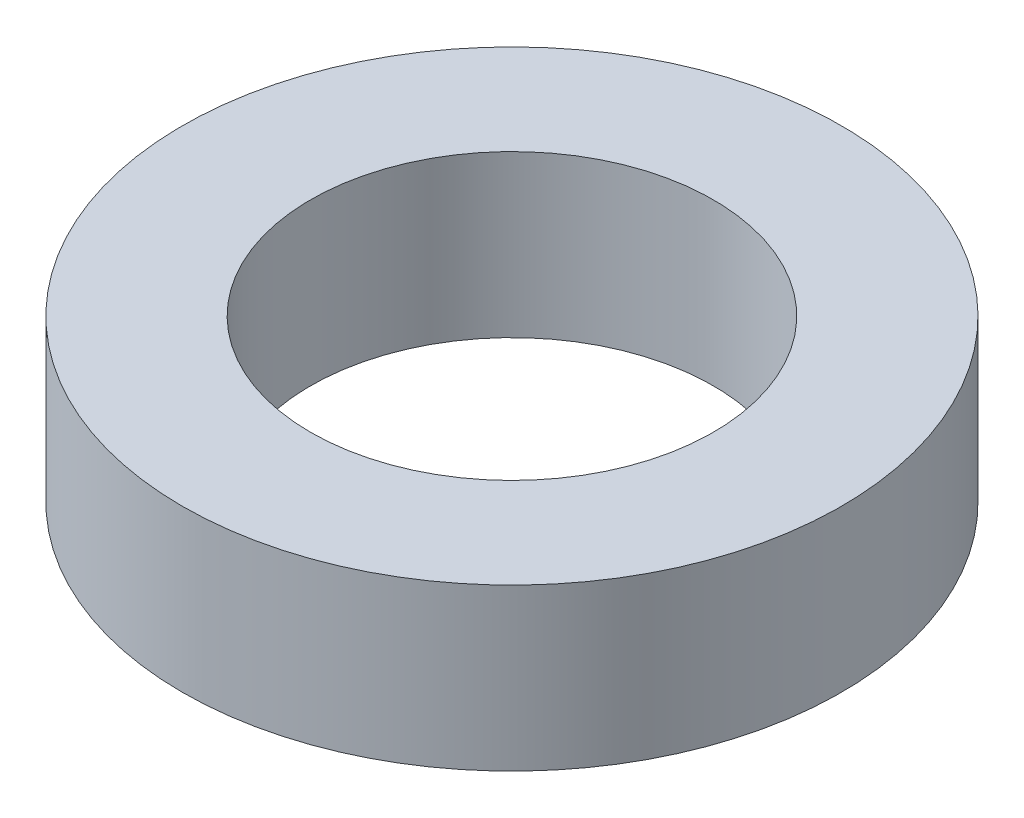
ISO-10303-21;
HEADER;
FILE_DESCRIPTION(('STEP AP214'),'2;1');
FILE_NAME('part.step','',(''),(''),'','','');
FILE_SCHEMA(('AUTOMOTIVE_DESIGN { 1 0 10303 214 1 1 1 1 }'));
ENDSEC;
DATA;
#1=APPLICATION_CONTEXT('core data for automotive mechanical design processes');
#2=APPLICATION_PROTOCOL_DEFINITION('international standard','automotive_design',2000,#1);
#3=PRODUCT_CONTEXT('',#1,'mechanical');
#4=PRODUCT('Part','Part','',(#3));
#5=PRODUCT_RELATED_PRODUCT_CATEGORY('part','',(#4));
#6=PRODUCT_DEFINITION_FORMATION('','',#4);
#7=PRODUCT_DEFINITION_CONTEXT('part definition',#1,'design');
#8=PRODUCT_DEFINITION('design','',#6,#7);
#9=PRODUCT_DEFINITION_SHAPE('','',#8);
#10=(LENGTH_UNIT() NAMED_UNIT(*) SI_UNIT(.MILLI.,.METRE.));
#11=(NAMED_UNIT(*) PLANE_ANGLE_UNIT() SI_UNIT($,.RADIAN.));
#12=(NAMED_UNIT(*) SI_UNIT($,.STERADIAN.) SOLID_ANGLE_UNIT());
#13=UNCERTAINTY_MEASURE_WITH_UNIT(LENGTH_MEASURE(1.E-05),#10,'distance_accuracy_value','');
#14=(GEOMETRIC_REPRESENTATION_CONTEXT(3) GLOBAL_UNCERTAINTY_ASSIGNED_CONTEXT((#13)) GLOBAL_UNIT_ASSIGNED_CONTEXT((#10,
#11,#12)) REPRESENTATION_CONTEXT('',''));
#15=CARTESIAN_POINT('',(0.,0.,0.));
#16=DIRECTION('',(0.,0.,1.));
#17=DIRECTION('',(1.,0.,0.));
#18=AXIS2_PLACEMENT_3D('',#15,#16,#17);
#19=CARTESIAN_POINT('',(0.,22.,0.));
#20=DIRECTION('',(0.,-1.,0.));
#21=DIRECTION('',(0.,0.,-1.));
#22=AXIS2_PLACEMENT_3D('',#19,#20,#21);
#23=CYLINDRICAL_SURFACE('',#22,45.);
#24=CARTESIAN_POINT('',(0.,22.,0.));
#25=DIRECTION('',(0.,1.,0.));
#26=DIRECTION('',(0.,0.,1.));
#27=AXIS2_PLACEMENT_3D('',#24,#25,#26);
#28=CIRCLE('',#27,45.);
#29=CARTESIAN_POINT('',(0.,22.,45.));
#30=VERTEX_POINT('',#29);
#31=EDGE_CURVE('E10',#30,#30,#28,.T.);
#32=ORIENTED_EDGE('',*,*,#31,.F.);
#33=EDGE_LOOP('',(#32));
#34=FACE_BOUND('',#33,.T.);
#35=CARTESIAN_POINT('',(0.,0.,0.));
#36=DIRECTION('',(0.,1.,0.));
#37=DIRECTION('',(0.,0.,1.));
#38=AXIS2_PLACEMENT_3D('',#35,#36,#37);
#39=CIRCLE('',#38,45.);
#40=CARTESIAN_POINT('',(0.,0.,45.));
#41=VERTEX_POINT('',#40);
#42=EDGE_CURVE('E37',#41,#41,#39,.T.);
#43=ORIENTED_EDGE('',*,*,#42,.T.);
#44=EDGE_LOOP('',(#43));
#45=FACE_BOUND('',#44,.T.);
#46=ADVANCED_FACE('F40',(#34,#45),#23,.T.);
#47=CARTESIAN_POINT('',(0.,22.,0.));
#48=DIRECTION('',(0.,1.,0.));
#49=DIRECTION('',(0.,0.,1.));
#50=AXIS2_PLACEMENT_3D('',#47,#48,#49);
#51=PLANE('',#50);
#52=CARTESIAN_POINT('',(0.,22.,0.));
#53=DIRECTION('',(0.,1.,0.));
#54=DIRECTION('',(0.,0.,1.));
#55=AXIS2_PLACEMENT_3D('',#52,#53,#54);
#56=CIRCLE('',#55,27.5);
#57=CARTESIAN_POINT('',(0.,22.,27.5));
#58=VERTEX_POINT('',#57);
#59=EDGE_CURVE('E50',#58,#58,#56,.T.);
#60=ORIENTED_EDGE('',*,*,#59,.F.);
#61=EDGE_LOOP('',(#60));
#62=FACE_BOUND('',#61,.T.);
#63=ORIENTED_EDGE('',*,*,#31,.T.);
#64=EDGE_LOOP('',(#63));
#65=FACE_BOUND('',#64,.T.);
#66=ADVANCED_FACE('F59',(#62,#65),#51,.T.);
#67=CARTESIAN_POINT('',(0.,0.,0.));
#68=DIRECTION('',(0.,1.,0.));
#69=DIRECTION('',(0.,0.,1.));
#70=AXIS2_PLACEMENT_3D('',#67,#68,#69);
#71=PLANE('',#70);
#72=CARTESIAN_POINT('',(0.,0.,0.));
#73=DIRECTION('',(0.,1.,0.));
#74=DIRECTION('',(0.,0.,1.));
#75=AXIS2_PLACEMENT_3D('',#72,#73,#74);
#76=CIRCLE('',#75,27.5);
#77=CARTESIAN_POINT('',(0.,0.,27.5));
#78=VERTEX_POINT('',#77);
#79=EDGE_CURVE('E47',#78,#78,#76,.T.);
#80=ORIENTED_EDGE('',*,*,#79,.T.);
#81=EDGE_LOOP('',(#80));
#82=FACE_BOUND('',#81,.T.);
#83=ORIENTED_EDGE('',*,*,#42,.F.);
#84=EDGE_LOOP('',(#83));
#85=FACE_BOUND('',#84,.T.);
#86=ADVANCED_FACE('F58',(#82,#85),#71,.F.);
#87=CARTESIAN_POINT('',(0.,22.,0.));
#88=DIRECTION('',(0.,-1.,0.));
#89=DIRECTION('',(0.,0.,-1.));
#90=AXIS2_PLACEMENT_3D('',#87,#88,#89);
#91=CYLINDRICAL_SURFACE('',#90,27.5);
#92=ORIENTED_EDGE('',*,*,#59,.T.);
#93=EDGE_LOOP('',(#92));
#94=FACE_BOUND('',#93,.T.);
#95=ORIENTED_EDGE('',*,*,#79,.F.);
#96=EDGE_LOOP('',(#95));
#97=FACE_BOUND('',#96,.T.);
#98=ADVANCED_FACE('F54',(#94,#97),#91,.F.);
#99=CLOSED_SHELL('',(#46,#66,#86,#98));
#100=MANIFOLD_SOLID_BREP('B2',#99);
#101=ADVANCED_BREP_SHAPE_REPRESENTATION('',(#18,#100),#14);
#102=SHAPE_DEFINITION_REPRESENTATION(#9,#101);
ENDSEC;
END-ISO-10303-21;
